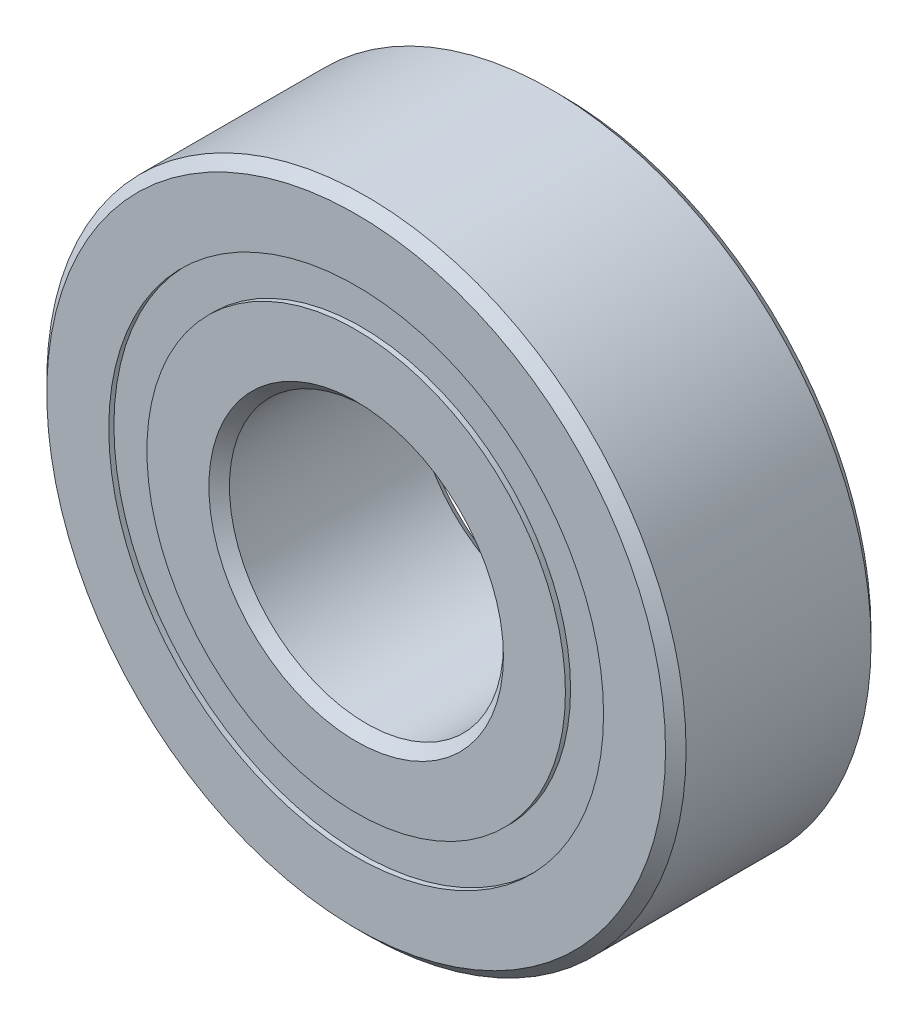
ISO-10303-21;
HEADER;
FILE_DESCRIPTION(('STEP AP214'),'2;1');
FILE_NAME('part.step','',(''),(''),'','','');
FILE_SCHEMA(('AUTOMOTIVE_DESIGN { 1 0 10303 214 1 1 1 1 }'));
ENDSEC;
DATA;
#1=APPLICATION_CONTEXT('core data for automotive mechanical design processes');
#2=APPLICATION_PROTOCOL_DEFINITION('international standard','automotive_design',2000,#1);
#3=PRODUCT_CONTEXT('',#1,'mechanical');
#4=PRODUCT('Part','Part','',(#3));
#5=PRODUCT_RELATED_PRODUCT_CATEGORY('part','',(#4));
#6=PRODUCT_DEFINITION_FORMATION('','',#4);
#7=PRODUCT_DEFINITION_CONTEXT('part definition',#1,'design');
#8=PRODUCT_DEFINITION('design','',#6,#7);
#9=PRODUCT_DEFINITION_SHAPE('','',#8);
#10=(LENGTH_UNIT() NAMED_UNIT(*) SI_UNIT(.MILLI.,.METRE.));
#11=(NAMED_UNIT(*) PLANE_ANGLE_UNIT() SI_UNIT($,.RADIAN.));
#12=(NAMED_UNIT(*) SI_UNIT($,.STERADIAN.) SOLID_ANGLE_UNIT());
#13=UNCERTAINTY_MEASURE_WITH_UNIT(LENGTH_MEASURE(1.E-05),#10,'distance_accuracy_value','');
#14=(GEOMETRIC_REPRESENTATION_CONTEXT(3) GLOBAL_UNCERTAINTY_ASSIGNED_CONTEXT((#13)) GLOBAL_UNIT_ASSIGNED_CONTEXT((#10,
#11,#12)) REPRESENTATION_CONTEXT('',''));
#15=CARTESIAN_POINT('',(0.,0.,0.));
#16=DIRECTION('',(0.,0.,1.));
#17=DIRECTION('',(1.,0.,0.));
#18=AXIS2_PLACEMENT_3D('',#15,#16,#17);
#19=CARTESIAN_POINT('',(0.,8.60041208791209,-3.39328125));
#20=DIRECTION('',(0.,0.,1.));
#21=DIRECTION('',(1.,0.,0.));
#22=AXIS2_PLACEMENT_3D('',#19,#20,#21);
#23=PLANE('',#22);
#24=CARTESIAN_POINT('',(0.,0.,-3.39328125));
#25=DIRECTION('',(0.,0.,1.));
#26=DIRECTION('',(1.,0.,0.));
#27=AXIS2_PLACEMENT_3D('',#24,#25,#26);
#28=CIRCLE('',#27,8.60041208791209);
#29=CARTESIAN_POINT('',(8.60041208791209,0.,-3.39328125));
#30=VERTEX_POINT('',#29);
#31=EDGE_CURVE('E55',#30,#30,#28,.T.);
#32=ORIENTED_EDGE('',*,*,#31,.F.);
#33=EDGE_LOOP('',(#32));
#34=FACE_BOUND('',#33,.T.);
#35=CARTESIAN_POINT('',(0.,0.,-3.39328125));
#36=DIRECTION('',(0.,0.,1.));
#37=DIRECTION('',(1.,0.,0.));
#38=AXIS2_PLACEMENT_3D('',#35,#36,#37);
#39=CIRCLE('',#38,7.27458791208791);
#40=CARTESIAN_POINT('',(7.27458791208791,0.,-3.39328125));
#41=VERTEX_POINT('',#40);
#42=EDGE_CURVE('E11',#41,#41,#39,.T.);
#43=ORIENTED_EDGE('',*,*,#42,.T.);
#44=EDGE_LOOP('',(#43));
#45=FACE_BOUND('',#44,.T.);
#46=ADVANCED_FACE('F41',(#34,#45),#23,.F.);
#47=CARTESIAN_POINT('',(0.,0.,3.571875));
#48=DIRECTION('',(0.,0.,1.));
#49=DIRECTION('',(1.,0.,0.));
#50=AXIS2_PLACEMENT_3D('',#47,#48,#49);
#51=CYLINDRICAL_SURFACE('',#50,7.27458791208791);
#52=ORIENTED_EDGE('',*,*,#42,.F.);
#53=EDGE_LOOP('',(#52));
#54=FACE_BOUND('',#53,.T.);
#55=CARTESIAN_POINT('',(0.,0.,-1.72035132641562));
#56=DIRECTION('',(0.,0.,1.));
#57=DIRECTION('',(1.,0.,0.));
#58=AXIS2_PLACEMENT_3D('',#55,#56,#57);
#59=CIRCLE('',#58,7.27458791208791);
#60=CARTESIAN_POINT('',(7.27458791208791,0.,-1.72035132641562));
#61=VERTEX_POINT('',#60);
#62=EDGE_CURVE('E47',#61,#61,#59,.T.);
#63=ORIENTED_EDGE('',*,*,#62,.T.);
#64=EDGE_LOOP('',(#63));
#65=FACE_BOUND('',#64,.T.);
#66=ADVANCED_FACE('F64',(#54,#65),#51,.F.);
#67=CARTESIAN_POINT('',(0.,8.60041208791209,-1.72035132641562));
#68=DIRECTION('',(0.,0.,-1.));
#69=DIRECTION('',(-1.,0.,0.));
#70=AXIS2_PLACEMENT_3D('',#67,#68,#69);
#71=PLANE('',#70);
#72=ORIENTED_EDGE('',*,*,#62,.F.);
#73=EDGE_LOOP('',(#72));
#74=FACE_BOUND('',#73,.T.);
#75=CARTESIAN_POINT('',(0.,0.,-1.72035132641562));
#76=DIRECTION('',(0.,0.,1.));
#77=DIRECTION('',(1.,0.,0.));
#78=AXIS2_PLACEMENT_3D('',#75,#76,#77);
#79=CIRCLE('',#78,8.60041208791209);
#80=CARTESIAN_POINT('',(8.60041208791209,0.,-1.72035132641562));
#81=VERTEX_POINT('',#80);
#82=EDGE_CURVE('E51',#81,#81,#79,.T.);
#83=ORIENTED_EDGE('',*,*,#82,.T.);
#84=EDGE_LOOP('',(#83));
#85=FACE_BOUND('',#84,.T.);
#86=ADVANCED_FACE('F68',(#74,#85),#71,.F.);
#87=CARTESIAN_POINT('',(0.,0.,3.571875));
#88=DIRECTION('',(0.,0.,1.));
#89=DIRECTION('',(1.,0.,0.));
#90=AXIS2_PLACEMENT_3D('',#87,#88,#89);
#91=CYLINDRICAL_SURFACE('',#90,8.60041208791209);
#92=ORIENTED_EDGE('',*,*,#82,.F.);
#93=EDGE_LOOP('',(#92));
#94=FACE_BOUND('',#93,.T.);
#95=ORIENTED_EDGE('',*,*,#31,.T.);
#96=EDGE_LOOP('',(#95));
#97=FACE_BOUND('',#96,.T.);
#98=ADVANCED_FACE('F61',(#94,#97),#91,.T.);
#99=CLOSED_SHELL('',(#46,#66,#86,#98));
#100=MANIFOLD_SOLID_BREP('B2',#99);
#101=CARTESIAN_POINT('',(0.,8.60041208791209,3.39328125));
#102=DIRECTION('',(0.,0.,-1.));
#103=DIRECTION('',(-1.,0.,0.));
#104=AXIS2_PLACEMENT_3D('',#101,#102,#103);
#105=PLANE('',#104);
#106=CARTESIAN_POINT('',(0.,0.,3.39328125));
#107=DIRECTION('',(0.,0.,1.));
#108=DIRECTION('',(1.,0.,0.));
#109=AXIS2_PLACEMENT_3D('',#106,#107,#108);
#110=CIRCLE('',#109,7.27458791208791);
#111=CARTESIAN_POINT('',(7.27458791208791,0.,3.39328125));
#112=VERTEX_POINT('',#111);
#113=EDGE_CURVE('E40',#112,#112,#110,.T.);
#114=ORIENTED_EDGE('',*,*,#113,.F.);
#115=EDGE_LOOP('',(#114));
#116=FACE_BOUND('',#115,.T.);
#117=CARTESIAN_POINT('',(0.,0.,3.39328125));
#118=DIRECTION('',(0.,0.,1.));
#119=DIRECTION('',(1.,0.,0.));
#120=AXIS2_PLACEMENT_3D('',#117,#118,#119);
#121=CIRCLE('',#120,8.60041208791209);
#122=CARTESIAN_POINT('',(8.60041208791209,0.,3.39328125));
#123=VERTEX_POINT('',#122);
#124=EDGE_CURVE('E122',#123,#123,#121,.T.);
#125=ORIENTED_EDGE('',*,*,#124,.T.);
#126=EDGE_LOOP('',(#125));
#127=FACE_BOUND('',#126,.T.);
#128=ADVANCED_FACE('F108',(#116,#127),#105,.F.);
#129=CARTESIAN_POINT('',(0.,0.,3.571875));
#130=DIRECTION('',(0.,0.,1.));
#131=DIRECTION('',(1.,0.,0.));
#132=AXIS2_PLACEMENT_3D('',#129,#130,#131);
#133=CYLINDRICAL_SURFACE('',#132,7.27458791208791);
#134=CARTESIAN_POINT('',(0.,0.,1.72035132641561));
#135=DIRECTION('',(0.,0.,1.));
#136=DIRECTION('',(1.,0.,0.));
#137=AXIS2_PLACEMENT_3D('',#134,#135,#136);
#138=CIRCLE('',#137,7.27458791208791);
#139=CARTESIAN_POINT('',(7.27458791208791,0.,1.72035132641561));
#140=VERTEX_POINT('',#139);
#141=EDGE_CURVE('E114',#140,#140,#138,.T.);
#142=ORIENTED_EDGE('',*,*,#141,.F.);
#143=EDGE_LOOP('',(#142));
#144=FACE_BOUND('',#143,.T.);
#145=ORIENTED_EDGE('',*,*,#113,.T.);
#146=EDGE_LOOP('',(#145));
#147=FACE_BOUND('',#146,.T.);
#148=ADVANCED_FACE('F137',(#144,#147),#133,.F.);
#149=CARTESIAN_POINT('',(0.,8.60041208791209,1.72035132641561));
#150=DIRECTION('',(0.,0.,1.));
#151=DIRECTION('',(1.,0.,0.));
#152=AXIS2_PLACEMENT_3D('',#149,#150,#151);
#153=PLANE('',#152);
#154=CARTESIAN_POINT('',(0.,0.,1.72035132641561));
#155=DIRECTION('',(0.,0.,1.));
#156=DIRECTION('',(1.,0.,0.));
#157=AXIS2_PLACEMENT_3D('',#154,#155,#156);
#158=CIRCLE('',#157,8.60041208791209);
#159=CARTESIAN_POINT('',(8.60041208791209,0.,1.72035132641561));
#160=VERTEX_POINT('',#159);
#161=EDGE_CURVE('E118',#160,#160,#158,.T.);
#162=ORIENTED_EDGE('',*,*,#161,.F.);
#163=EDGE_LOOP('',(#162));
#164=FACE_BOUND('',#163,.T.);
#165=ORIENTED_EDGE('',*,*,#141,.T.);
#166=EDGE_LOOP('',(#165));
#167=FACE_BOUND('',#166,.T.);
#168=ADVANCED_FACE('F132',(#164,#167),#153,.F.);
#169=CARTESIAN_POINT('',(0.,0.,3.571875));
#170=DIRECTION('',(0.,0.,1.));
#171=DIRECTION('',(1.,0.,0.));
#172=AXIS2_PLACEMENT_3D('',#169,#170,#171);
#173=CYLINDRICAL_SURFACE('',#172,8.60041208791209);
#174=ORIENTED_EDGE('',*,*,#124,.F.);
#175=EDGE_LOOP('',(#174));
#176=FACE_BOUND('',#175,.T.);
#177=ORIENTED_EDGE('',*,*,#161,.T.);
#178=EDGE_LOOP('',(#177));
#179=FACE_BOUND('',#178,.T.);
#180=ADVANCED_FACE('F129',(#176,#179),#173,.T.);
#181=CLOSED_SHELL('',(#128,#148,#168,#180));
#182=MANIFOLD_SOLID_BREP('B6',#181);
#183=CARTESIAN_POINT('',(-4.66554544007142,6.42157239285121,0.));
#184=DIRECTION('',(0.,0.,1.));
#185=DIRECTION('',(-0.587785252292462,0.809016994374955,0.));
#186=AXIS2_PLACEMENT_3D('',#183,#184,#185);
#187=SPHERICAL_SURFACE('',#186,1.72035132641561);
#188=CARTESIAN_POINT('',(-4.66554544007142,6.42157239285121,1.72035132641561));
#189=VERTEX_POINT('',#188);
#190=VERTEX_LOOP('',#189);
#191=FACE_BOUND('',#190,.T.);
#192=ADVANCED_FACE('F175',(#191),#187,.T.);
#193=CLOSED_SHELL('',(#192));
#194=MANIFOLD_SOLID_BREP('B35',#193);
#195=CARTESIAN_POINT('',(-7.54901109809275,2.45282239285123,0.));
#196=DIRECTION('',(0.,0.,1.));
#197=DIRECTION('',(-0.95105651629515,0.309016994374958,0.));
#198=AXIS2_PLACEMENT_3D('',#195,#196,#197);
#199=SPHERICAL_SURFACE('',#198,1.72035132641561);
#200=CARTESIAN_POINT('',(-7.54901109809275,2.45282239285123,1.72035132641561));
#201=VERTEX_POINT('',#200);
#202=VERTEX_LOOP('',#201);
#203=FACE_BOUND('',#202,.T.);
#204=ADVANCED_FACE('F195',(#203),#199,.T.);
#205=CLOSED_SHELL('',(#204));
#206=MANIFOLD_SOLID_BREP('B104',#205);
#207=CARTESIAN_POINT('',(-7.54901109809281,-2.45282239285107,0.));
#208=DIRECTION('',(0.,0.,1.));
#209=DIRECTION('',(-0.951056516295157,-0.309016994374938,0.));
#210=AXIS2_PLACEMENT_3D('',#207,#208,#209);
#211=SPHERICAL_SURFACE('',#210,1.72035132641561);
#212=CARTESIAN_POINT('',(-7.54901109809281,-2.45282239285107,1.72035132641561));
#213=VERTEX_POINT('',#212);
#214=VERTEX_LOOP('',#213);
#215=FACE_BOUND('',#214,.T.);
#216=ADVANCED_FACE('F215',(#215),#211,.T.);
#217=CLOSED_SHELL('',(#216));
#218=MANIFOLD_SOLID_BREP('B171',#217);
#219=CARTESIAN_POINT('',(-4.66554544007156,-6.4215723928511,0.));
#220=DIRECTION('',(0.,0.,1.));
#221=DIRECTION('',(-0.58778525229248,-0.809016994374942,0.));
#222=AXIS2_PLACEMENT_3D('',#219,#220,#221);
#223=SPHERICAL_SURFACE('',#222,1.72035132641561);
#224=CARTESIAN_POINT('',(-4.66554544007156,-6.4215723928511,1.72035132641561));
#225=VERTEX_POINT('',#224);
#226=VERTEX_LOOP('',#225);
#227=FACE_BOUND('',#226,.T.);
#228=ADVANCED_FACE('F235',(#227),#223,.T.);
#229=CLOSED_SHELL('',(#228));
#230=MANIFOLD_SOLID_BREP('B191',#229);
#231=CARTESIAN_POINT('',(0.,-7.9375,0.));
#232=DIRECTION('',(0.,0.,1.));
#233=DIRECTION('',(0.,-1.,0.));
#234=AXIS2_PLACEMENT_3D('',#231,#232,#233);
#235=SPHERICAL_SURFACE('',#234,1.72035132641561);
#236=CARTESIAN_POINT('',(0.,-7.9375,1.72035132641561));
#237=VERTEX_POINT('',#236);
#238=VERTEX_LOOP('',#237);
#239=FACE_BOUND('',#238,.T.);
#240=ADVANCED_FACE('F255',(#239),#235,.T.);
#241=CLOSED_SHELL('',(#240));
#242=MANIFOLD_SOLID_BREP('B211',#241);
#243=CARTESIAN_POINT('',(4.66554544007147,-6.42157239285117,0.));
#244=DIRECTION('',(0.,0.,1.));
#245=DIRECTION('',(0.587785252292469,-0.809016994374951,0.));
#246=AXIS2_PLACEMENT_3D('',#243,#244,#245);
#247=SPHERICAL_SURFACE('',#246,1.72035132641561);
#248=CARTESIAN_POINT('',(4.66554544007147,-6.42157239285117,1.72035132641561));
#249=VERTEX_POINT('',#248);
#250=VERTEX_LOOP('',#249);
#251=FACE_BOUND('',#250,.T.);
#252=ADVANCED_FACE('F275',(#251),#247,.T.);
#253=CLOSED_SHELL('',(#252));
#254=MANIFOLD_SOLID_BREP('B231',#253);
#255=CARTESIAN_POINT('',(7.54901109809277,-2.45282239285118,0.));
#256=DIRECTION('',(0.,0.,1.));
#257=DIRECTION('',(0.951056516295152,-0.309016994374952,0.));
#258=AXIS2_PLACEMENT_3D('',#255,#256,#257);
#259=SPHERICAL_SURFACE('',#258,1.72035132641561);
#260=CARTESIAN_POINT('',(7.54901109809277,-2.45282239285118,1.72035132641561));
#261=VERTEX_POINT('',#260);
#262=VERTEX_LOOP('',#261);
#263=FACE_BOUND('',#262,.T.);
#264=ADVANCED_FACE('F295',(#263),#259,.T.);
#265=CLOSED_SHELL('',(#264));
#266=MANIFOLD_SOLID_BREP('B251',#265);
#267=CARTESIAN_POINT('',(7.54901109809279,2.45282239285112,0.));
#268=DIRECTION('',(0.,0.,1.));
#269=DIRECTION('',(0.951056516295155,0.309016994374945,0.));
#270=AXIS2_PLACEMENT_3D('',#267,#268,#269);
#271=SPHERICAL_SURFACE('',#270,1.72035132641561);
#272=CARTESIAN_POINT('',(7.54901109809279,2.45282239285112,1.72035132641561));
#273=VERTEX_POINT('',#272);
#274=VERTEX_LOOP('',#273);
#275=FACE_BOUND('',#274,.T.);
#276=ADVANCED_FACE('F315',(#275),#271,.T.);
#277=CLOSED_SHELL('',(#276));
#278=MANIFOLD_SOLID_BREP('B271',#277);
#279=CARTESIAN_POINT('',(4.66554544007152,6.42157239285114,0.));
#280=DIRECTION('',(0.,0.,1.));
#281=DIRECTION('',(0.587785252292474,0.809016994374947,0.));
#282=AXIS2_PLACEMENT_3D('',#279,#280,#281);
#283=SPHERICAL_SURFACE('',#282,1.72035132641561);
#284=CARTESIAN_POINT('',(4.66554544007152,6.42157239285114,1.72035132641561));
#285=VERTEX_POINT('',#284);
#286=VERTEX_LOOP('',#285);
#287=FACE_BOUND('',#286,.T.);
#288=ADVANCED_FACE('F335',(#287),#283,.T.);
#289=CLOSED_SHELL('',(#288));
#290=MANIFOLD_SOLID_BREP('B291',#289);
#291=CARTESIAN_POINT('',(0.,7.9375,0.));
#292=DIRECTION('',(0.,0.,1.));
#293=DIRECTION('',(0.,1.,0.));
#294=AXIS2_PLACEMENT_3D('',#291,#292,#293);
#295=SPHERICAL_SURFACE('',#294,1.72035132641561);
#296=CARTESIAN_POINT('',(0.,7.9375,1.72035132641561));
#297=VERTEX_POINT('',#296);
#298=VERTEX_LOOP('',#297);
#299=FACE_BOUND('',#298,.T.);
#300=ADVANCED_FACE('F357',(#299),#295,.T.);
#301=CLOSED_SHELL('',(#300));
#302=MANIFOLD_SOLID_BREP('B311',#301);
#303=CARTESIAN_POINT('',(0.,7.27458791208791,3.571875));
#304=DIRECTION('',(0.,0.,-1.));
#305=DIRECTION('',(-1.,0.,0.));
#306=AXIS2_PLACEMENT_3D('',#303,#304,#305);
#307=PLANE('',#306);
#308=CARTESIAN_POINT('',(0.,0.,3.571875));
#309=DIRECTION('',(0.,0.,1.));
#310=DIRECTION('',(1.,0.,0.));
#311=AXIS2_PLACEMENT_3D('',#308,#309,#310);
#312=CIRCLE('',#311,5.1196875);
#313=CARTESIAN_POINT('',(5.1196875,0.,3.571875));
#314=VERTEX_POINT('',#313);
#315=EDGE_CURVE('E404',#314,#314,#312,.T.);
#316=ORIENTED_EDGE('',*,*,#315,.F.);
#317=EDGE_LOOP('',(#316));
#318=FACE_BOUND('',#317,.T.);
#319=CARTESIAN_POINT('',(0.,0.,3.571875));
#320=DIRECTION('',(0.,0.,1.));
#321=DIRECTION('',(1.,0.,0.));
#322=AXIS2_PLACEMENT_3D('',#319,#320,#321);
#323=CIRCLE('',#322,7.27458791208791);
#324=CARTESIAN_POINT('',(7.27458791208791,0.,3.571875));
#325=VERTEX_POINT('',#324);
#326=EDGE_CURVE('E356',#325,#325,#323,.T.);
#327=ORIENTED_EDGE('',*,*,#326,.T.);
#328=EDGE_LOOP('',(#327));
#329=FACE_BOUND('',#328,.T.);
#330=ADVANCED_FACE('F376',(#318,#329),#307,.F.);
#331=CARTESIAN_POINT('',(0.,0.,3.571875));
#332=DIRECTION('',(0.,0.,1.));
#333=DIRECTION('',(1.,0.,0.));
#334=AXIS2_PLACEMENT_3D('',#331,#332,#333);
#335=CYLINDRICAL_SURFACE('',#334,7.27458791208791);
#336=ORIENTED_EDGE('',*,*,#326,.F.);
#337=EDGE_LOOP('',(#336));
#338=FACE_BOUND('',#337,.T.);
#339=CARTESIAN_POINT('',(0.,0.,1.5875));
#340=DIRECTION('',(0.,0.,1.));
#341=DIRECTION('',(1.,0.,0.));
#342=AXIS2_PLACEMENT_3D('',#339,#340,#341);
#343=CIRCLE('',#342,7.27458791208791);
#344=CARTESIAN_POINT('',(7.27458791208791,0.,1.5875));
#345=VERTEX_POINT('',#344);
#346=EDGE_CURVE('E382',#345,#345,#343,.T.);
#347=ORIENTED_EDGE('',*,*,#346,.T.);
#348=EDGE_LOOP('',(#347));
#349=FACE_BOUND('',#348,.T.);
#350=ADVANCED_FACE('F411',(#338,#349),#335,.T.);
#351=CARTESIAN_POINT('',(0.,0.,0.));
#352=DIRECTION('',(0.,0.,1.));
#353=DIRECTION('',(1.,0.,0.));
#354=AXIS2_PLACEMENT_3D('',#351,#352,#353);
#355=TOROIDAL_SURFACE('',#354,7.93749999999999,1.72035132641561);
#356=ORIENTED_EDGE('',*,*,#346,.F.);
#357=EDGE_LOOP('',(#356));
#358=FACE_BOUND('',#357,.T.);
#359=CARTESIAN_POINT('',(0.,0.,-1.5875));
#360=DIRECTION('',(0.,0.,1.));
#361=DIRECTION('',(1.,0.,0.));
#362=AXIS2_PLACEMENT_3D('',#359,#360,#361);
#363=CIRCLE('',#362,7.27458791208791);
#364=CARTESIAN_POINT('',(7.27458791208791,0.,-1.5875));
#365=VERTEX_POINT('',#364);
#366=EDGE_CURVE('E386',#365,#365,#363,.T.);
#367=ORIENTED_EDGE('',*,*,#366,.T.);
#368=EDGE_LOOP('',(#367));
#369=FACE_BOUND('',#368,.T.);
#370=ADVANCED_FACE('F415',(#358,#369),#355,.F.);
#371=CARTESIAN_POINT('',(0.,0.,3.571875));
#372=DIRECTION('',(0.,0.,1.));
#373=DIRECTION('',(1.,0.,0.));
#374=AXIS2_PLACEMENT_3D('',#371,#372,#373);
#375=CYLINDRICAL_SURFACE('',#374,7.27458791208791);
#376=ORIENTED_EDGE('',*,*,#366,.F.);
#377=EDGE_LOOP('',(#376));
#378=FACE_BOUND('',#377,.T.);
#379=CARTESIAN_POINT('',(0.,0.,-3.571875));
#380=DIRECTION('',(0.,0.,1.));
#381=DIRECTION('',(1.,0.,0.));
#382=AXIS2_PLACEMENT_3D('',#379,#380,#381);
#383=CIRCLE('',#382,7.27458791208791);
#384=CARTESIAN_POINT('',(7.27458791208791,0.,-3.571875));
#385=VERTEX_POINT('',#384);
#386=EDGE_CURVE('E390',#385,#385,#383,.T.);
#387=ORIENTED_EDGE('',*,*,#386,.T.);
#388=EDGE_LOOP('',(#387));
#389=FACE_BOUND('',#388,.T.);
#390=ADVANCED_FACE('F420',(#378,#389),#375,.T.);
#391=CARTESIAN_POINT('',(0.,5.1196875,-3.571875));
#392=DIRECTION('',(0.,0.,1.));
#393=DIRECTION('',(1.,0.,0.));
#394=AXIS2_PLACEMENT_3D('',#391,#392,#393);
#395=PLANE('',#394);
#396=ORIENTED_EDGE('',*,*,#386,.F.);
#397=EDGE_LOOP('',(#396));
#398=FACE_BOUND('',#397,.T.);
#399=CARTESIAN_POINT('',(0.,0.,-3.571875));
#400=DIRECTION('',(0.,0.,1.));
#401=DIRECTION('',(1.,0.,0.));
#402=AXIS2_PLACEMENT_3D('',#399,#400,#401);
#403=CIRCLE('',#402,5.1196875);
#404=CARTESIAN_POINT('',(5.1196875,0.,-3.571875));
#405=VERTEX_POINT('',#404);
#406=EDGE_CURVE('E395',#405,#405,#403,.T.);
#407=ORIENTED_EDGE('',*,*,#406,.T.);
#408=EDGE_LOOP('',(#407));
#409=FACE_BOUND('',#408,.T.);
#410=ADVANCED_FACE('F426',(#398,#409),#395,.F.);
#411=CARTESIAN_POINT('',(0.,0.,-3.2146875));
#412=DIRECTION('',(0.,0.,-1.));
#413=DIRECTION('',(-1.,0.,0.));
#414=AXIS2_PLACEMENT_3D('',#411,#412,#413);
#415=CONICAL_SURFACE('',#414,4.7625,0.785398163397442);
#416=ORIENTED_EDGE('',*,*,#406,.F.);
#417=EDGE_LOOP('',(#416));
#418=FACE_BOUND('',#417,.T.);
#419=CARTESIAN_POINT('',(0.,0.,-3.2146875));
#420=DIRECTION('',(0.,0.,1.));
#421=DIRECTION('',(1.,0.,0.));
#422=AXIS2_PLACEMENT_3D('',#419,#420,#421);
#423=CIRCLE('',#422,4.7625);
#424=CARTESIAN_POINT('',(4.7625,0.,-3.2146875));
#425=VERTEX_POINT('',#424);
#426=EDGE_CURVE('E398',#425,#425,#423,.T.);
#427=ORIENTED_EDGE('',*,*,#426,.T.);
#428=EDGE_LOOP('',(#427));
#429=FACE_BOUND('',#428,.T.);
#430=ADVANCED_FACE('F430',(#418,#429),#415,.F.);
#431=CARTESIAN_POINT('',(0.,0.,3.571875));
#432=DIRECTION('',(0.,0.,1.));
#433=DIRECTION('',(1.,0.,0.));
#434=AXIS2_PLACEMENT_3D('',#431,#432,#433);
#435=CYLINDRICAL_SURFACE('',#434,4.7625);
#436=ORIENTED_EDGE('',*,*,#426,.F.);
#437=EDGE_LOOP('',(#436));
#438=FACE_BOUND('',#437,.T.);
#439=CARTESIAN_POINT('',(0.,0.,3.2146875));
#440=DIRECTION('',(0.,0.,1.));
#441=DIRECTION('',(1.,0.,0.));
#442=AXIS2_PLACEMENT_3D('',#439,#440,#441);
#443=CIRCLE('',#442,4.7625);
#444=CARTESIAN_POINT('',(4.7625,0.,3.2146875));
#445=VERTEX_POINT('',#444);
#446=EDGE_CURVE('E401',#445,#445,#443,.T.);
#447=ORIENTED_EDGE('',*,*,#446,.T.);
#448=EDGE_LOOP('',(#447));
#449=FACE_BOUND('',#448,.T.);
#450=ADVANCED_FACE('F434',(#438,#449),#435,.F.);
#451=CARTESIAN_POINT('',(0.,0.,3.571875));
#452=DIRECTION('',(0.,0.,1.));
#453=DIRECTION('',(1.,0.,0.));
#454=AXIS2_PLACEMENT_3D('',#451,#452,#453);
#455=CONICAL_SURFACE('',#454,5.1196875,0.785398163397453);
#456=ORIENTED_EDGE('',*,*,#446,.F.);
#457=EDGE_LOOP('',(#456));
#458=FACE_BOUND('',#457,.T.);
#459=ORIENTED_EDGE('',*,*,#315,.T.);
#460=EDGE_LOOP('',(#459));
#461=FACE_BOUND('',#460,.T.);
#462=ADVANCED_FACE('F408',(#458,#461),#455,.F.);
#463=CLOSED_SHELL('',(#330,#350,#370,#390,#410,#430,#450,#462));
#464=MANIFOLD_SOLID_BREP('B331',#463);
#465=CARTESIAN_POINT('',(0.,0.,3.2146875));
#466=DIRECTION('',(0.,0.,-1.));
#467=DIRECTION('',(-1.,0.,0.));
#468=AXIS2_PLACEMENT_3D('',#465,#466,#467);
#469=CONICAL_SURFACE('',#468,11.1125,0.785398163397446);
#470=CARTESIAN_POINT('',(0.,0.,3.571875));
#471=DIRECTION('',(0.,0.,1.));
#472=DIRECTION('',(1.,0.,0.));
#473=AXIS2_PLACEMENT_3D('',#470,#471,#472);
#474=CIRCLE('',#473,10.7553125);
#475=CARTESIAN_POINT('',(10.7553125,0.,3.571875));
#476=VERTEX_POINT('',#475);
#477=EDGE_CURVE('E525',#476,#476,#474,.T.);
#478=ORIENTED_EDGE('',*,*,#477,.F.);
#479=EDGE_LOOP('',(#478));
#480=FACE_BOUND('',#479,.T.);
#481=CARTESIAN_POINT('',(0.,0.,3.2146875));
#482=DIRECTION('',(0.,0.,1.));
#483=DIRECTION('',(1.,0.,0.));
#484=AXIS2_PLACEMENT_3D('',#481,#482,#483);
#485=CIRCLE('',#484,11.1125);
#486=CARTESIAN_POINT('',(11.1125,0.,3.2146875));
#487=VERTEX_POINT('',#486);
#488=EDGE_CURVE('E375',#487,#487,#485,.T.);
#489=ORIENTED_EDGE('',*,*,#488,.T.);
#490=EDGE_LOOP('',(#489));
#491=FACE_BOUND('',#490,.T.);
#492=ADVANCED_FACE('F497',(#480,#491),#469,.T.);
#493=CARTESIAN_POINT('',(0.,0.,3.571875));
#494=DIRECTION('',(0.,0.,1.));
#495=DIRECTION('',(1.,0.,0.));
#496=AXIS2_PLACEMENT_3D('',#493,#494,#495);
#497=CYLINDRICAL_SURFACE('',#496,11.1125);
#498=ORIENTED_EDGE('',*,*,#488,.F.);
#499=EDGE_LOOP('',(#498));
#500=FACE_BOUND('',#499,.T.);
#501=CARTESIAN_POINT('',(0.,0.,-3.2146875));
#502=DIRECTION('',(0.,0.,1.));
#503=DIRECTION('',(1.,0.,0.));
#504=AXIS2_PLACEMENT_3D('',#501,#502,#503);
#505=CIRCLE('',#504,11.1125);
#506=CARTESIAN_POINT('',(11.1125,0.,-3.2146875));
#507=VERTEX_POINT('',#506);
#508=EDGE_CURVE('E503',#507,#507,#505,.T.);
#509=ORIENTED_EDGE('',*,*,#508,.T.);
#510=EDGE_LOOP('',(#509));
#511=FACE_BOUND('',#510,.T.);
#512=ADVANCED_FACE('F532',(#500,#511),#497,.T.);
#513=CARTESIAN_POINT('',(0.,0.,-3.571875));
#514=DIRECTION('',(0.,0.,1.));
#515=DIRECTION('',(1.,0.,0.));
#516=AXIS2_PLACEMENT_3D('',#513,#514,#515);
#517=CONICAL_SURFACE('',#516,10.7553125,0.785398163397444);
#518=ORIENTED_EDGE('',*,*,#508,.F.);
#519=EDGE_LOOP('',(#518));
#520=FACE_BOUND('',#519,.T.);
#521=CARTESIAN_POINT('',(0.,0.,-3.571875));
#522=DIRECTION('',(0.,0.,1.));
#523=DIRECTION('',(1.,0.,0.));
#524=AXIS2_PLACEMENT_3D('',#521,#522,#523);
#525=CIRCLE('',#524,10.7553125);
#526=CARTESIAN_POINT('',(10.7553125,0.,-3.571875));
#527=VERTEX_POINT('',#526);
#528=EDGE_CURVE('E507',#527,#527,#525,.T.);
#529=ORIENTED_EDGE('',*,*,#528,.T.);
#530=EDGE_LOOP('',(#529));
#531=FACE_BOUND('',#530,.T.);
#532=ADVANCED_FACE('F536',(#520,#531),#517,.T.);
#533=CARTESIAN_POINT('',(0.,10.7553125,-3.571875));
#534=DIRECTION('',(0.,0.,1.));
#535=DIRECTION('',(1.,0.,0.));
#536=AXIS2_PLACEMENT_3D('',#533,#534,#535);
#537=PLANE('',#536);
#538=ORIENTED_EDGE('',*,*,#528,.F.);
#539=EDGE_LOOP('',(#538));
#540=FACE_BOUND('',#539,.T.);
#541=CARTESIAN_POINT('',(0.,0.,-3.571875));
#542=DIRECTION('',(0.,0.,1.));
#543=DIRECTION('',(1.,0.,0.));
#544=AXIS2_PLACEMENT_3D('',#541,#542,#543);
#545=CIRCLE('',#544,8.60041208791209);
#546=CARTESIAN_POINT('',(8.60041208791209,0.,-3.571875));
#547=VERTEX_POINT('',#546);
#548=EDGE_CURVE('E511',#547,#547,#545,.T.);
#549=ORIENTED_EDGE('',*,*,#548,.T.);
#550=EDGE_LOOP('',(#549));
#551=FACE_BOUND('',#550,.T.);
#552=ADVANCED_FACE('F541',(#540,#551),#537,.F.);
#553=CARTESIAN_POINT('',(0.,0.,3.571875));
#554=DIRECTION('',(0.,0.,1.));
#555=DIRECTION('',(1.,0.,0.));
#556=AXIS2_PLACEMENT_3D('',#553,#554,#555);
#557=CYLINDRICAL_SURFACE('',#556,8.60041208791209);
#558=ORIENTED_EDGE('',*,*,#548,.F.);
#559=EDGE_LOOP('',(#558));
#560=FACE_BOUND('',#559,.T.);
#561=CARTESIAN_POINT('',(0.,0.,-1.5875));
#562=DIRECTION('',(0.,0.,1.));
#563=DIRECTION('',(1.,0.,0.));
#564=AXIS2_PLACEMENT_3D('',#561,#562,#563);
#565=CIRCLE('',#564,8.60041208791209);
#566=CARTESIAN_POINT('',(8.60041208791209,0.,-1.5875));
#567=VERTEX_POINT('',#566);
#568=EDGE_CURVE('E516',#567,#567,#565,.T.);
#569=ORIENTED_EDGE('',*,*,#568,.T.);
#570=EDGE_LOOP('',(#569));
#571=FACE_BOUND('',#570,.T.);
#572=ADVANCED_FACE('F547',(#560,#571),#557,.F.);
#573=CARTESIAN_POINT('',(0.,0.,0.));
#574=DIRECTION('',(0.,0.,1.));
#575=DIRECTION('',(1.,0.,0.));
#576=AXIS2_PLACEMENT_3D('',#573,#574,#575);
#577=TOROIDAL_SURFACE('',#576,7.9375,1.72035132641561);
#578=ORIENTED_EDGE('',*,*,#568,.F.);
#579=EDGE_LOOP('',(#578));
#580=FACE_BOUND('',#579,.T.);
#581=CARTESIAN_POINT('',(0.,0.,1.5875));
#582=DIRECTION('',(0.,0.,1.));
#583=DIRECTION('',(1.,0.,0.));
#584=AXIS2_PLACEMENT_3D('',#581,#582,#583);
#585=CIRCLE('',#584,8.60041208791209);
#586=CARTESIAN_POINT('',(8.60041208791209,0.,1.5875));
#587=VERTEX_POINT('',#586);
#588=EDGE_CURVE('E519',#587,#587,#585,.T.);
#589=ORIENTED_EDGE('',*,*,#588,.T.);
#590=EDGE_LOOP('',(#589));
#591=FACE_BOUND('',#590,.T.);
#592=ADVANCED_FACE('F551',(#580,#591),#577,.F.);
#593=CARTESIAN_POINT('',(0.,0.,3.571875));
#594=DIRECTION('',(0.,0.,1.));
#595=DIRECTION('',(1.,0.,0.));
#596=AXIS2_PLACEMENT_3D('',#593,#594,#595);
#597=CYLINDRICAL_SURFACE('',#596,8.60041208791209);
#598=ORIENTED_EDGE('',*,*,#588,.F.);
#599=EDGE_LOOP('',(#598));
#600=FACE_BOUND('',#599,.T.);
#601=CARTESIAN_POINT('',(0.,0.,3.571875));
#602=DIRECTION('',(0.,0.,1.));
#603=DIRECTION('',(1.,0.,0.));
#604=AXIS2_PLACEMENT_3D('',#601,#602,#603);
#605=CIRCLE('',#604,8.60041208791209);
#606=CARTESIAN_POINT('',(8.60041208791209,0.,3.571875));
#607=VERTEX_POINT('',#606);
#608=EDGE_CURVE('E522',#607,#607,#605,.T.);
#609=ORIENTED_EDGE('',*,*,#608,.T.);
#610=EDGE_LOOP('',(#609));
#611=FACE_BOUND('',#610,.T.);
#612=ADVANCED_FACE('F555',(#600,#611),#597,.F.);
#613=CARTESIAN_POINT('',(0.,10.7553125,3.571875));
#614=DIRECTION('',(0.,0.,-1.));
#615=DIRECTION('',(-1.,0.,0.));
#616=AXIS2_PLACEMENT_3D('',#613,#614,#615);
#617=PLANE('',#616);
#618=ORIENTED_EDGE('',*,*,#608,.F.);
#619=EDGE_LOOP('',(#618));
#620=FACE_BOUND('',#619,.T.);
#621=ORIENTED_EDGE('',*,*,#477,.T.);
#622=EDGE_LOOP('',(#621));
#623=FACE_BOUND('',#622,.T.);
#624=ADVANCED_FACE('F529',(#620,#623),#617,.F.);
#625=CLOSED_SHELL('',(#492,#512,#532,#552,#572,#592,#612,#624));
#626=MANIFOLD_SOLID_BREP('B351',#625);
#627=ADVANCED_BREP_SHAPE_REPRESENTATION('',(#18,#100,#182,#194,#206,#218,#230,#242,#254,#266,
#278,#290,#302,#464,#626),#14);
#628=SHAPE_DEFINITION_REPRESENTATION(#9,#627);
ENDSEC;
END-ISO-10303-21;
